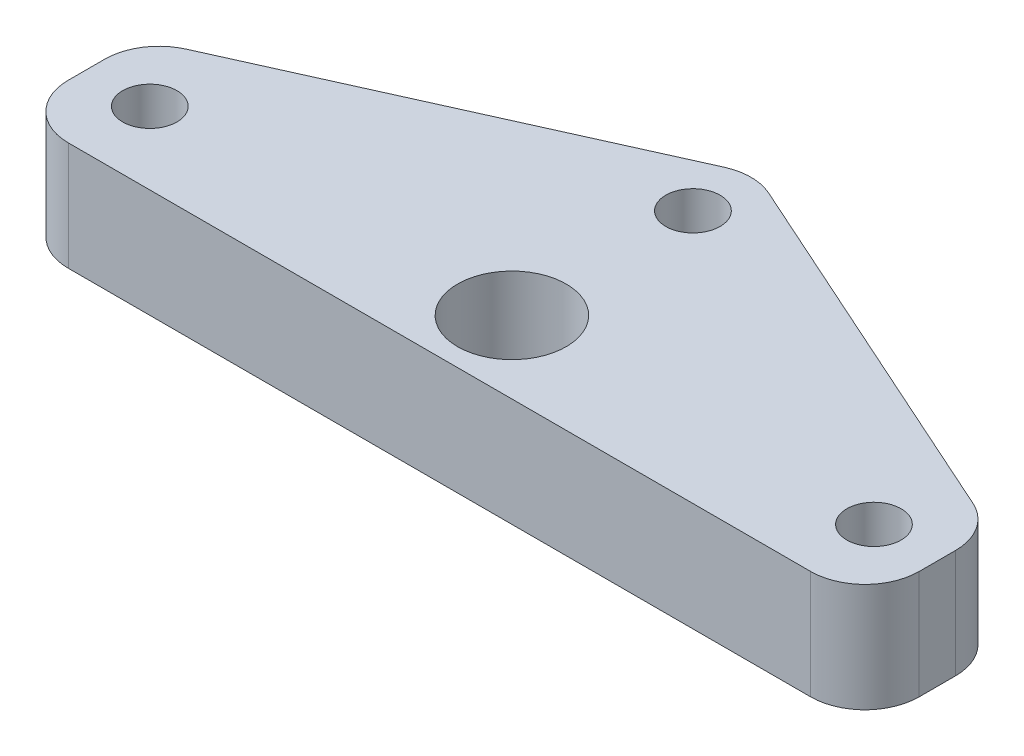
ISO-10303-21;
HEADER;
FILE_DESCRIPTION(('STEP AP214'),'2;1');
FILE_NAME('part.step','',(''),(''),'','','');
FILE_SCHEMA(('AUTOMOTIVE_DESIGN { 1 0 10303 214 1 1 1 1 }'));
ENDSEC;
DATA;
#1=APPLICATION_CONTEXT('core data for automotive mechanical design processes');
#2=APPLICATION_PROTOCOL_DEFINITION('international standard','automotive_design',2000,#1);
#3=PRODUCT_CONTEXT('',#1,'mechanical');
#4=PRODUCT('Part','Part','',(#3));
#5=PRODUCT_RELATED_PRODUCT_CATEGORY('part','',(#4));
#6=PRODUCT_DEFINITION_FORMATION('','',#4);
#7=PRODUCT_DEFINITION_CONTEXT('part definition',#1,'design');
#8=PRODUCT_DEFINITION('design','',#6,#7);
#9=PRODUCT_DEFINITION_SHAPE('','',#8);
#10=(LENGTH_UNIT() NAMED_UNIT(*) SI_UNIT(.MILLI.,.METRE.));
#11=(NAMED_UNIT(*) PLANE_ANGLE_UNIT() SI_UNIT($,.RADIAN.));
#12=(NAMED_UNIT(*) SI_UNIT($,.STERADIAN.) SOLID_ANGLE_UNIT());
#13=UNCERTAINTY_MEASURE_WITH_UNIT(LENGTH_MEASURE(1.E-05),#10,'distance_accuracy_value','');
#14=(GEOMETRIC_REPRESENTATION_CONTEXT(3) GLOBAL_UNCERTAINTY_ASSIGNED_CONTEXT((#13)) GLOBAL_UNIT_ASSIGNED_CONTEXT((#10,
#11,#12)) REPRESENTATION_CONTEXT('',''));
#15=CARTESIAN_POINT('',(0.,0.,0.));
#16=DIRECTION('',(0.,0.,1.));
#17=DIRECTION('',(1.,0.,0.));
#18=AXIS2_PLACEMENT_3D('',#15,#16,#17);
#19=CARTESIAN_POINT('',(0.,6.,0.));
#20=DIRECTION('',(0.,-1.,0.));
#21=DIRECTION('',(0.,0.,-1.));
#22=AXIS2_PLACEMENT_3D('',#19,#20,#21);
#23=PLANE('',#22);
#24=DIRECTION('',(0.,0.,1.));
#25=VECTOR('',#24,1.);
#26=CARTESIAN_POINT('',(-23.5,6.,0.));
#27=LINE('',#26,#25);
#28=CARTESIAN_POINT('',(-23.5,6.,-5.00468255148093));
#29=VERTEX_POINT('',#28);
#30=CARTESIAN_POINT('',(-23.5,6.,-2.99999999999999));
#31=VERTEX_POINT('',#30);
#32=EDGE_CURVE('E210',#29,#31,#27,.T.);
#33=ORIENTED_EDGE('',*,*,#32,.T.);
#34=CARTESIAN_POINT('',(-20.5,6.,-2.99999999999999));
#35=DIRECTION('',(0.,-1.,0.));
#36=DIRECTION('',(0.,0.,-1.));
#37=AXIS2_PLACEMENT_3D('',#34,#35,#36);
#38=CIRCLE('',#37,3.);
#39=CARTESIAN_POINT('',(-20.5,6.,0.));
#40=VERTEX_POINT('',#39);
#41=EDGE_CURVE('E169',#31,#40,#38,.F.);
#42=ORIENTED_EDGE('',*,*,#41,.T.);
#43=DIRECTION('',(1.,0.,0.));
#44=VECTOR('',#43,1.);
#45=CARTESIAN_POINT('',(23.5,6.,0.));
#46=LINE('',#45,#44);
#47=CARTESIAN_POINT('',(20.5,6.,0.));
#48=VERTEX_POINT('',#47);
#49=EDGE_CURVE('E135',#40,#48,#46,.T.);
#50=ORIENTED_EDGE('',*,*,#49,.T.);
#51=CARTESIAN_POINT('',(20.5,6.,-2.99999999999999));
#52=DIRECTION('',(0.,-1.,0.));
#53=DIRECTION('',(0.,0.,-1.));
#54=AXIS2_PLACEMENT_3D('',#51,#52,#53);
#55=CIRCLE('',#54,3.);
#56=CARTESIAN_POINT('',(23.5,6.,-2.99999999999999));
#57=VERTEX_POINT('',#56);
#58=EDGE_CURVE('E162',#48,#57,#55,.F.);
#59=ORIENTED_EDGE('',*,*,#58,.T.);
#60=DIRECTION('',(0.,0.,-1.));
#61=VECTOR('',#60,1.);
#62=CARTESIAN_POINT('',(23.5,6.,-6.94602272727272));
#63=LINE('',#62,#61);
#64=CARTESIAN_POINT('',(23.5,6.,-5.00468255148093));
#65=VERTEX_POINT('',#64);
#66=EDGE_CURVE('E142',#57,#65,#63,.T.);
#67=ORIENTED_EDGE('',*,*,#66,.T.);
#68=CARTESIAN_POINT('',(20.5,6.,-5.00468255148093));
#69=DIRECTION('',(0.,-1.,0.));
#70=DIRECTION('',(0.,0.,-1.));
#71=AXIS2_PLACEMENT_3D('',#68,#69,#70);
#72=CIRCLE('',#71,3.);
#73=CARTESIAN_POINT('',(21.7290577738734,6.,-7.74136247220262));
#74=VERTEX_POINT('',#73);
#75=EDGE_CURVE('E164',#65,#74,#72,.F.);
#76=ORIENTED_EDGE('',*,*,#75,.T.);
#77=DIRECTION('',(-0.912226640240563,0.,-0.40968592462448));
#78=VECTOR('',#77,1.);
#79=CARTESIAN_POINT('',(0.,6.,-17.5));
#80=LINE('',#79,#78);
#81=CARTESIAN_POINT('',(1.22905777387344,6.,-16.9480234973477));
#82=VERTEX_POINT('',#81);
#83=EDGE_CURVE('E146',#74,#82,#80,.T.);
#84=ORIENTED_EDGE('',*,*,#83,.T.);
#85=CARTESIAN_POINT('',(0.,6.,-14.211343576626));
#86=DIRECTION('',(0.,-1.,0.));
#87=DIRECTION('',(0.,0.,-1.));
#88=AXIS2_PLACEMENT_3D('',#85,#86,#87);
#89=CIRCLE('',#88,3.);
#90=CARTESIAN_POINT('',(-1.22905777387343,6.,-16.9480234973477));
#91=VERTEX_POINT('',#90);
#92=EDGE_CURVE('E59',#82,#91,#89,.F.);
#93=ORIENTED_EDGE('',*,*,#92,.T.);
#94=DIRECTION('',(-0.912226640240563,0.,0.40968592462448));
#95=VECTOR('',#94,1.);
#96=CARTESIAN_POINT('',(-23.5,6.,-6.94602272727272));
#97=LINE('',#96,#95);
#98=CARTESIAN_POINT('',(-21.7290577738734,6.,-7.74136247220262));
#99=VERTEX_POINT('',#98);
#100=EDGE_CURVE('E211',#91,#99,#97,.T.);
#101=ORIENTED_EDGE('',*,*,#100,.T.);
#102=CARTESIAN_POINT('',(-20.5,6.,-5.00468255148093));
#103=DIRECTION('',(0.,-1.,0.));
#104=DIRECTION('',(0.,0.,-1.));
#105=AXIS2_PLACEMENT_3D('',#102,#103,#104);
#106=CIRCLE('',#105,3.);
#107=EDGE_CURVE('E167',#99,#29,#106,.F.);
#108=ORIENTED_EDGE('',*,*,#107,.T.);
#109=EDGE_LOOP('',(#33,#42,#50,#59,#67,#76,#84,#93,#101,#108));
#110=FACE_BOUND('',#109,.T.);
#111=CARTESIAN_POINT('',(0.,6.,-4.));
#112=DIRECTION('',(0.,1.,0.));
#113=DIRECTION('',(0.,0.,1.));
#114=AXIS2_PLACEMENT_3D('',#111,#112,#113);
#115=CIRCLE('',#114,3.);
#116=CARTESIAN_POINT('',(0.,6.,-0.999999999999997));
#117=VERTEX_POINT('',#116);
#118=EDGE_CURVE('E191',#117,#117,#115,.T.);
#119=ORIENTED_EDGE('',*,*,#118,.F.);
#120=EDGE_LOOP('',(#119));
#121=FACE_BOUND('',#120,.T.);
#122=CARTESIAN_POINT('',(20.,6.,-4.));
#123=DIRECTION('',(0.,1.,0.));
#124=DIRECTION('',(0.,0.,1.));
#125=AXIS2_PLACEMENT_3D('',#122,#123,#124);
#126=CIRCLE('',#125,1.5);
#127=CARTESIAN_POINT('',(20.,6.,-2.5));
#128=VERTEX_POINT('',#127);
#129=EDGE_CURVE('E218',#128,#128,#126,.T.);
#130=ORIENTED_EDGE('',*,*,#129,.F.);
#131=EDGE_LOOP('',(#130));
#132=FACE_BOUND('',#131,.T.);
#133=CARTESIAN_POINT('',(-20.,6.,-4.));
#134=DIRECTION('',(0.,1.,0.));
#135=DIRECTION('',(0.,0.,1.));
#136=AXIS2_PLACEMENT_3D('',#133,#134,#135);
#137=CIRCLE('',#136,1.5);
#138=CARTESIAN_POINT('',(-20.,6.,-2.5));
#139=VERTEX_POINT('',#138);
#140=EDGE_CURVE('E223',#139,#139,#137,.T.);
#141=ORIENTED_EDGE('',*,*,#140,.F.);
#142=EDGE_LOOP('',(#141));
#143=FACE_BOUND('',#142,.T.);
#144=CARTESIAN_POINT('',(0.,6.,-14.));
#145=DIRECTION('',(0.,1.,0.));
#146=DIRECTION('',(0.,0.,1.));
#147=AXIS2_PLACEMENT_3D('',#144,#145,#146);
#148=CIRCLE('',#147,1.5);
#149=CARTESIAN_POINT('',(0.,6.,-12.5));
#150=VERTEX_POINT('',#149);
#151=EDGE_CURVE('E229',#150,#150,#148,.T.);
#152=ORIENTED_EDGE('',*,*,#151,.F.);
#153=EDGE_LOOP('',(#152));
#154=FACE_BOUND('',#153,.T.);
#155=ADVANCED_FACE('F37',(#110,#121,#132,#143,#154),#23,.F.);
#156=CARTESIAN_POINT('',(0.,0.,0.));
#157=DIRECTION('',(0.,-1.,0.));
#158=DIRECTION('',(0.,0.,-1.));
#159=AXIS2_PLACEMENT_3D('',#156,#157,#158);
#160=PLANE('',#159);
#161=CARTESIAN_POINT('',(-20.,0.,-4.));
#162=DIRECTION('',(0.,1.,0.));
#163=DIRECTION('',(0.,0.,1.));
#164=AXIS2_PLACEMENT_3D('',#161,#162,#163);
#165=CIRCLE('',#164,1.5);
#166=CARTESIAN_POINT('',(-20.,0.,-2.5));
#167=VERTEX_POINT('',#166);
#168=EDGE_CURVE('E226',#167,#167,#165,.T.);
#169=ORIENTED_EDGE('',*,*,#168,.T.);
#170=EDGE_LOOP('',(#169));
#171=FACE_BOUND('',#170,.T.);
#172=CARTESIAN_POINT('',(0.,0.,-4.));
#173=DIRECTION('',(0.,1.,0.));
#174=DIRECTION('',(0.,0.,1.));
#175=AXIS2_PLACEMENT_3D('',#172,#173,#174);
#176=CIRCLE('',#175,3.);
#177=CARTESIAN_POINT('',(0.,0.,-0.999999999999997));
#178=VERTEX_POINT('',#177);
#179=EDGE_CURVE('E196',#178,#178,#176,.T.);
#180=ORIENTED_EDGE('',*,*,#179,.T.);
#181=EDGE_LOOP('',(#180));
#182=FACE_BOUND('',#181,.T.);
#183=DIRECTION('',(1.,0.,0.));
#184=VECTOR('',#183,1.);
#185=CARTESIAN_POINT('',(23.5,0.,0.));
#186=LINE('',#185,#184);
#187=CARTESIAN_POINT('',(-20.5,0.,0.));
#188=VERTEX_POINT('',#187);
#189=CARTESIAN_POINT('',(20.5,0.,0.));
#190=VERTEX_POINT('',#189);
#191=EDGE_CURVE('E132',#188,#190,#186,.T.);
#192=ORIENTED_EDGE('',*,*,#191,.F.);
#193=CARTESIAN_POINT('',(-20.5,0.,-2.99999999999999));
#194=DIRECTION('',(0.,-1.,0.));
#195=DIRECTION('',(0.,0.,-1.));
#196=AXIS2_PLACEMENT_3D('',#193,#194,#195);
#197=CIRCLE('',#196,3.);
#198=CARTESIAN_POINT('',(-23.5,0.,-2.99999999999999));
#199=VERTEX_POINT('',#198);
#200=EDGE_CURVE('E115',#188,#199,#197,.T.);
#201=ORIENTED_EDGE('',*,*,#200,.T.);
#202=DIRECTION('',(0.,0.,1.));
#203=VECTOR('',#202,1.);
#204=CARTESIAN_POINT('',(-23.5,0.,0.));
#205=LINE('',#204,#203);
#206=CARTESIAN_POINT('',(-23.5,0.,-5.00468255148093));
#207=VERTEX_POINT('',#206);
#208=EDGE_CURVE('E143',#207,#199,#205,.T.);
#209=ORIENTED_EDGE('',*,*,#208,.F.);
#210=CARTESIAN_POINT('',(-20.5,0.,-5.00468255148093));
#211=DIRECTION('',(0.,-1.,0.));
#212=DIRECTION('',(0.,0.,-1.));
#213=AXIS2_PLACEMENT_3D('',#210,#211,#212);
#214=CIRCLE('',#213,3.);
#215=CARTESIAN_POINT('',(-21.7290577738734,0.,-7.74136247220262));
#216=VERTEX_POINT('',#215);
#217=EDGE_CURVE('E126',#207,#216,#214,.T.);
#218=ORIENTED_EDGE('',*,*,#217,.T.);
#219=DIRECTION('',(-0.912226640240563,0.,0.40968592462448));
#220=VECTOR('',#219,1.);
#221=CARTESIAN_POINT('',(-23.5,0.,-6.94602272727272));
#222=LINE('',#221,#220);
#223=CARTESIAN_POINT('',(-1.22905777387343,0.,-16.9480234973477));
#224=VERTEX_POINT('',#223);
#225=EDGE_CURVE('E148',#224,#216,#222,.T.);
#226=ORIENTED_EDGE('',*,*,#225,.F.);
#227=CARTESIAN_POINT('',(0.,0.,-14.211343576626));
#228=DIRECTION('',(0.,-1.,0.));
#229=DIRECTION('',(0.,0.,-1.));
#230=AXIS2_PLACEMENT_3D('',#227,#228,#229);
#231=CIRCLE('',#230,3.);
#232=CARTESIAN_POINT('',(1.22905777387344,0.,-16.9480234973477));
#233=VERTEX_POINT('',#232);
#234=EDGE_CURVE('E156',#224,#233,#231,.T.);
#235=ORIENTED_EDGE('',*,*,#234,.T.);
#236=DIRECTION('',(-0.912226640240563,0.,-0.40968592462448));
#237=VECTOR('',#236,1.);
#238=CARTESIAN_POINT('',(0.,0.,-17.5));
#239=LINE('',#238,#237);
#240=CARTESIAN_POINT('',(21.7290577738734,0.,-7.74136247220262));
#241=VERTEX_POINT('',#240);
#242=EDGE_CURVE('E190',#241,#233,#239,.T.);
#243=ORIENTED_EDGE('',*,*,#242,.F.);
#244=CARTESIAN_POINT('',(20.5,0.,-5.00468255148093));
#245=DIRECTION('',(0.,-1.,0.));
#246=DIRECTION('',(0.,0.,-1.));
#247=AXIS2_PLACEMENT_3D('',#244,#245,#246);
#248=CIRCLE('',#247,3.);
#249=CARTESIAN_POINT('',(23.5,0.,-5.00468255148093));
#250=VERTEX_POINT('',#249);
#251=EDGE_CURVE('E154',#241,#250,#248,.T.);
#252=ORIENTED_EDGE('',*,*,#251,.T.);
#253=DIRECTION('',(0.,0.,-1.));
#254=VECTOR('',#253,1.);
#255=CARTESIAN_POINT('',(23.5,0.,-6.94602272727272));
#256=LINE('',#255,#254);
#257=CARTESIAN_POINT('',(23.5,0.,-2.99999999999999));
#258=VERTEX_POINT('',#257);
#259=EDGE_CURVE('E185',#258,#250,#256,.T.);
#260=ORIENTED_EDGE('',*,*,#259,.F.);
#261=CARTESIAN_POINT('',(20.5,0.,-2.99999999999999));
#262=DIRECTION('',(0.,-1.,0.));
#263=DIRECTION('',(0.,0.,-1.));
#264=AXIS2_PLACEMENT_3D('',#261,#262,#263);
#265=CIRCLE('',#264,3.);
#266=EDGE_CURVE('E136',#258,#190,#265,.T.);
#267=ORIENTED_EDGE('',*,*,#266,.T.);
#268=EDGE_LOOP('',(#192,#201,#209,#218,#226,#235,#243,#252,#260,#267));
#269=FACE_BOUND('',#268,.T.);
#270=CARTESIAN_POINT('',(20.,0.,-4.));
#271=DIRECTION('',(0.,1.,0.));
#272=DIRECTION('',(0.,0.,1.));
#273=AXIS2_PLACEMENT_3D('',#270,#271,#272);
#274=CIRCLE('',#273,1.5);
#275=CARTESIAN_POINT('',(20.,0.,-2.5));
#276=VERTEX_POINT('',#275);
#277=EDGE_CURVE('E220',#276,#276,#274,.T.);
#278=ORIENTED_EDGE('',*,*,#277,.T.);
#279=EDGE_LOOP('',(#278));
#280=FACE_BOUND('',#279,.T.);
#281=CARTESIAN_POINT('',(0.,0.,-14.));
#282=DIRECTION('',(0.,1.,0.));
#283=DIRECTION('',(0.,0.,1.));
#284=AXIS2_PLACEMENT_3D('',#281,#282,#283);
#285=CIRCLE('',#284,1.5);
#286=CARTESIAN_POINT('',(0.,0.,-12.5));
#287=VERTEX_POINT('',#286);
#288=EDGE_CURVE('E232',#287,#287,#285,.T.);
#289=ORIENTED_EDGE('',*,*,#288,.T.);
#290=EDGE_LOOP('',(#289));
#291=FACE_BOUND('',#290,.T.);
#292=ADVANCED_FACE('F139',(#171,#182,#269,#280,#291),#160,.T.);
#293=CARTESIAN_POINT('',(23.5,6.,-6.94602272727272));
#294=DIRECTION('',(-1.,0.,0.));
#295=DIRECTION('',(0.,0.,1.));
#296=AXIS2_PLACEMENT_3D('',#293,#294,#295);
#297=PLANE('',#296);
#298=ORIENTED_EDGE('',*,*,#259,.T.);
#299=DIRECTION('',(0.,-1.,0.));
#300=VECTOR('',#299,1.);
#301=CARTESIAN_POINT('',(23.5,6.,-5.00468255148093));
#302=LINE('',#301,#300);
#303=EDGE_CURVE('E11',#250,#65,#302,.F.);
#304=ORIENTED_EDGE('',*,*,#303,.T.);
#305=ORIENTED_EDGE('',*,*,#66,.F.);
#306=DIRECTION('',(0.,-1.,0.));
#307=VECTOR('',#306,1.);
#308=CARTESIAN_POINT('',(23.5,6.,-2.99999999999999));
#309=LINE('',#308,#307);
#310=EDGE_CURVE('E45',#57,#258,#309,.T.);
#311=ORIENTED_EDGE('',*,*,#310,.T.);
#312=EDGE_LOOP('',(#298,#304,#305,#311));
#313=FACE_BOUND('',#312,.T.);
#314=ADVANCED_FACE('F184',(#313),#297,.F.);
#315=CARTESIAN_POINT('',(0.,6.,-17.5));
#316=DIRECTION('',(-0.40968592462448,0.,0.912226640240563));
#317=DIRECTION('',(0.912226640240563,0.,0.40968592462448));
#318=AXIS2_PLACEMENT_3D('',#315,#316,#317);
#319=PLANE('',#318);
#320=ORIENTED_EDGE('',*,*,#242,.T.);
#321=DIRECTION('',(0.,-1.,0.));
#322=VECTOR('',#321,1.);
#323=CARTESIAN_POINT('',(1.22905777387344,6.,-16.9480234973477));
#324=LINE('',#323,#322);
#325=EDGE_CURVE('E178',#233,#82,#324,.F.);
#326=ORIENTED_EDGE('',*,*,#325,.T.);
#327=ORIENTED_EDGE('',*,*,#83,.F.);
#328=DIRECTION('',(0.,-1.,0.));
#329=VECTOR('',#328,1.);
#330=CARTESIAN_POINT('',(21.7290577738734,6.,-7.74136247220262));
#331=LINE('',#330,#329);
#332=EDGE_CURVE('E175',#74,#241,#331,.T.);
#333=ORIENTED_EDGE('',*,*,#332,.T.);
#334=EDGE_LOOP('',(#320,#326,#327,#333));
#335=FACE_BOUND('',#334,.T.);
#336=ADVANCED_FACE('F258',(#335),#319,.F.);
#337=CARTESIAN_POINT('',(-23.5,6.,-6.94602272727272));
#338=DIRECTION('',(0.40968592462448,0.,0.912226640240563));
#339=DIRECTION('',(0.912226640240563,0.,-0.40968592462448));
#340=AXIS2_PLACEMENT_3D('',#337,#338,#339);
#341=PLANE('',#340);
#342=ORIENTED_EDGE('',*,*,#225,.T.);
#343=DIRECTION('',(0.,-1.,0.));
#344=VECTOR('',#343,1.);
#345=CARTESIAN_POINT('',(-21.7290577738734,6.,-7.74136247220262));
#346=LINE('',#345,#344);
#347=EDGE_CURVE('E52',#216,#99,#346,.F.);
#348=ORIENTED_EDGE('',*,*,#347,.T.);
#349=ORIENTED_EDGE('',*,*,#100,.F.);
#350=DIRECTION('',(0.,-1.,0.));
#351=VECTOR('',#350,1.);
#352=CARTESIAN_POINT('',(-1.22905777387343,6.,-16.9480234973477));
#353=LINE('',#352,#351);
#354=EDGE_CURVE('E171',#91,#224,#353,.T.);
#355=ORIENTED_EDGE('',*,*,#354,.T.);
#356=EDGE_LOOP('',(#342,#348,#349,#355));
#357=FACE_BOUND('',#356,.T.);
#358=ADVANCED_FACE('F201',(#357),#341,.F.);
#359=CARTESIAN_POINT('',(-23.5,6.,0.));
#360=DIRECTION('',(1.,0.,0.));
#361=DIRECTION('',(0.,0.,-1.));
#362=AXIS2_PLACEMENT_3D('',#359,#360,#361);
#363=PLANE('',#362);
#364=ORIENTED_EDGE('',*,*,#208,.T.);
#365=DIRECTION('',(0.,-1.,0.));
#366=VECTOR('',#365,1.);
#367=CARTESIAN_POINT('',(-23.5,6.,-2.99999999999999));
#368=LINE('',#367,#366);
#369=EDGE_CURVE('E120',#199,#31,#368,.F.);
#370=ORIENTED_EDGE('',*,*,#369,.T.);
#371=ORIENTED_EDGE('',*,*,#32,.F.);
#372=DIRECTION('',(0.,-1.,0.));
#373=VECTOR('',#372,1.);
#374=CARTESIAN_POINT('',(-23.5,6.,-5.00468255148093));
#375=LINE('',#374,#373);
#376=EDGE_CURVE('E125',#29,#207,#375,.T.);
#377=ORIENTED_EDGE('',*,*,#376,.T.);
#378=EDGE_LOOP('',(#364,#370,#371,#377));
#379=FACE_BOUND('',#378,.T.);
#380=ADVANCED_FACE('F213',(#379),#363,.F.);
#381=CARTESIAN_POINT('',(23.5,6.,0.));
#382=DIRECTION('',(0.,0.,-1.));
#383=DIRECTION('',(-1.,0.,0.));
#384=AXIS2_PLACEMENT_3D('',#381,#382,#383);
#385=PLANE('',#384);
#386=ORIENTED_EDGE('',*,*,#49,.F.);
#387=DIRECTION('',(0.,-1.,0.));
#388=VECTOR('',#387,1.);
#389=CARTESIAN_POINT('',(-20.5,6.,0.));
#390=LINE('',#389,#388);
#391=EDGE_CURVE('E119',#40,#188,#390,.T.);
#392=ORIENTED_EDGE('',*,*,#391,.T.);
#393=ORIENTED_EDGE('',*,*,#191,.T.);
#394=DIRECTION('',(0.,-1.,0.));
#395=VECTOR('',#394,1.);
#396=CARTESIAN_POINT('',(20.5,6.,0.));
#397=LINE('',#396,#395);
#398=EDGE_CURVE('E137',#190,#48,#397,.F.);
#399=ORIENTED_EDGE('',*,*,#398,.T.);
#400=EDGE_LOOP('',(#386,#392,#393,#399));
#401=FACE_BOUND('',#400,.T.);
#402=ADVANCED_FACE('F131',(#401),#385,.F.);
#403=CARTESIAN_POINT('',(0.,6.,-4.));
#404=DIRECTION('',(0.,-1.,0.));
#405=DIRECTION('',(0.,0.,-1.));
#406=AXIS2_PLACEMENT_3D('',#403,#404,#405);
#407=CYLINDRICAL_SURFACE('',#406,3.);
#408=ORIENTED_EDGE('',*,*,#118,.T.);
#409=EDGE_LOOP('',(#408));
#410=FACE_BOUND('',#409,.T.);
#411=ORIENTED_EDGE('',*,*,#179,.F.);
#412=EDGE_LOOP('',(#411));
#413=FACE_BOUND('',#412,.T.);
#414=ADVANCED_FACE('F249',(#410,#413),#407,.F.);
#415=CARTESIAN_POINT('',(20.,6.,-4.));
#416=DIRECTION('',(0.,-1.,0.));
#417=DIRECTION('',(0.,0.,-1.));
#418=AXIS2_PLACEMENT_3D('',#415,#416,#417);
#419=CYLINDRICAL_SURFACE('',#418,1.5);
#420=ORIENTED_EDGE('',*,*,#129,.T.);
#421=EDGE_LOOP('',(#420));
#422=FACE_BOUND('',#421,.T.);
#423=ORIENTED_EDGE('',*,*,#277,.F.);
#424=EDGE_LOOP('',(#423));
#425=FACE_BOUND('',#424,.T.);
#426=ADVANCED_FACE('F365',(#422,#425),#419,.F.);
#427=CARTESIAN_POINT('',(-20.,6.,-4.));
#428=DIRECTION('',(0.,-1.,0.));
#429=DIRECTION('',(0.,0.,-1.));
#430=AXIS2_PLACEMENT_3D('',#427,#428,#429);
#431=CYLINDRICAL_SURFACE('',#430,1.5);
#432=ORIENTED_EDGE('',*,*,#140,.T.);
#433=EDGE_LOOP('',(#432));
#434=FACE_BOUND('',#433,.T.);
#435=ORIENTED_EDGE('',*,*,#168,.F.);
#436=EDGE_LOOP('',(#435));
#437=FACE_BOUND('',#436,.T.);
#438=ADVANCED_FACE('F356',(#434,#437),#431,.F.);
#439=CARTESIAN_POINT('',(0.,6.,-14.));
#440=DIRECTION('',(0.,-1.,0.));
#441=DIRECTION('',(0.,0.,-1.));
#442=AXIS2_PLACEMENT_3D('',#439,#440,#441);
#443=CYLINDRICAL_SURFACE('',#442,1.5);
#444=ORIENTED_EDGE('',*,*,#151,.T.);
#445=EDGE_LOOP('',(#444));
#446=FACE_BOUND('',#445,.T.);
#447=ORIENTED_EDGE('',*,*,#288,.F.);
#448=EDGE_LOOP('',(#447));
#449=FACE_BOUND('',#448,.T.);
#450=ADVANCED_FACE('F238',(#446,#449),#443,.F.);
#451=CARTESIAN_POINT('',(-20.5,6.,-2.99999999999999));
#452=DIRECTION('',(0.,-1.,0.));
#453=DIRECTION('',(0.,0.,-1.));
#454=AXIS2_PLACEMENT_3D('',#451,#452,#453);
#455=CYLINDRICAL_SURFACE('',#454,3.);
#456=ORIENTED_EDGE('',*,*,#41,.F.);
#457=ORIENTED_EDGE('',*,*,#369,.F.);
#458=ORIENTED_EDGE('',*,*,#200,.F.);
#459=ORIENTED_EDGE('',*,*,#391,.F.);
#460=EDGE_LOOP('',(#456,#457,#458,#459));
#461=FACE_BOUND('',#460,.T.);
#462=ADVANCED_FACE('F118',(#461),#455,.T.);
#463=CARTESIAN_POINT('',(-20.5,6.,-5.00468255148093));
#464=DIRECTION('',(0.,-1.,0.));
#465=DIRECTION('',(0.,0.,-1.));
#466=AXIS2_PLACEMENT_3D('',#463,#464,#465);
#467=CYLINDRICAL_SURFACE('',#466,3.);
#468=ORIENTED_EDGE('',*,*,#107,.F.);
#469=ORIENTED_EDGE('',*,*,#347,.F.);
#470=ORIENTED_EDGE('',*,*,#217,.F.);
#471=ORIENTED_EDGE('',*,*,#376,.F.);
#472=EDGE_LOOP('',(#468,#469,#470,#471));
#473=FACE_BOUND('',#472,.T.);
#474=ADVANCED_FACE('F205',(#473),#467,.T.);
#475=CARTESIAN_POINT('',(0.,6.,-14.211343576626));
#476=DIRECTION('',(0.,-1.,0.));
#477=DIRECTION('',(0.,0.,-1.));
#478=AXIS2_PLACEMENT_3D('',#475,#476,#477);
#479=CYLINDRICAL_SURFACE('',#478,3.);
#480=ORIENTED_EDGE('',*,*,#92,.F.);
#481=ORIENTED_EDGE('',*,*,#325,.F.);
#482=ORIENTED_EDGE('',*,*,#234,.F.);
#483=ORIENTED_EDGE('',*,*,#354,.F.);
#484=EDGE_LOOP('',(#480,#481,#482,#483));
#485=FACE_BOUND('',#484,.T.);
#486=ADVANCED_FACE('F268',(#485),#479,.T.);
#487=CARTESIAN_POINT('',(20.5,6.,-5.00468255148093));
#488=DIRECTION('',(0.,-1.,0.));
#489=DIRECTION('',(0.,0.,-1.));
#490=AXIS2_PLACEMENT_3D('',#487,#488,#489);
#491=CYLINDRICAL_SURFACE('',#490,3.);
#492=ORIENTED_EDGE('',*,*,#75,.F.);
#493=ORIENTED_EDGE('',*,*,#303,.F.);
#494=ORIENTED_EDGE('',*,*,#251,.F.);
#495=ORIENTED_EDGE('',*,*,#332,.F.);
#496=EDGE_LOOP('',(#492,#493,#494,#495));
#497=FACE_BOUND('',#496,.T.);
#498=ADVANCED_FACE('F270',(#497),#491,.T.);
#499=CARTESIAN_POINT('',(20.5,6.,-2.99999999999999));
#500=DIRECTION('',(0.,-1.,0.));
#501=DIRECTION('',(0.,0.,-1.));
#502=AXIS2_PLACEMENT_3D('',#499,#500,#501);
#503=CYLINDRICAL_SURFACE('',#502,3.);
#504=ORIENTED_EDGE('',*,*,#58,.F.);
#505=ORIENTED_EDGE('',*,*,#398,.F.);
#506=ORIENTED_EDGE('',*,*,#266,.F.);
#507=ORIENTED_EDGE('',*,*,#310,.F.);
#508=EDGE_LOOP('',(#504,#505,#506,#507));
#509=FACE_BOUND('',#508,.T.);
#510=ADVANCED_FACE('F39',(#509),#503,.T.);
#511=CLOSED_SHELL('',(#155,#292,#314,#336,#358,#380,#402,#414,#426,#438,#450,#462,#474,#486,
#498,#510));
#512=MANIFOLD_SOLID_BREP('B2',#511);
#513=ADVANCED_BREP_SHAPE_REPRESENTATION('',(#18,#512),#14);
#514=SHAPE_DEFINITION_REPRESENTATION(#9,#513);
ENDSEC;
END-ISO-10303-21;
